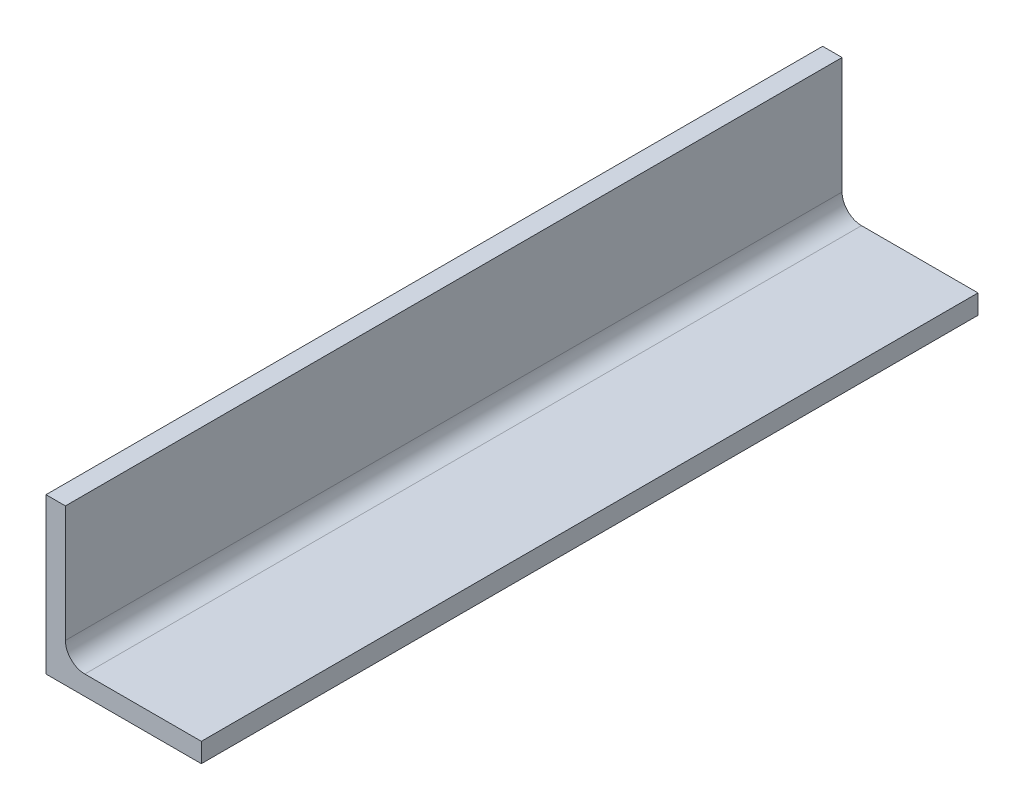
ISO-10303-21;
HEADER;
FILE_DESCRIPTION(('STEP AP214'),'2;1');
FILE_NAME('part.step','',(''),(''),'','','');
FILE_SCHEMA(('AUTOMOTIVE_DESIGN { 1 0 10303 214 1 1 1 1 }'));
ENDSEC;
DATA;
#1=APPLICATION_CONTEXT('core data for automotive mechanical design processes');
#2=APPLICATION_PROTOCOL_DEFINITION('international standard','automotive_design',2000,#1);
#3=PRODUCT_CONTEXT('',#1,'mechanical');
#4=PRODUCT('Part','Part','',(#3));
#5=PRODUCT_RELATED_PRODUCT_CATEGORY('part','',(#4));
#6=PRODUCT_DEFINITION_FORMATION('','',#4);
#7=PRODUCT_DEFINITION_CONTEXT('part definition',#1,'design');
#8=PRODUCT_DEFINITION('design','',#6,#7);
#9=PRODUCT_DEFINITION_SHAPE('','',#8);
#10=(LENGTH_UNIT() NAMED_UNIT(*) SI_UNIT(.MILLI.,.METRE.));
#11=(NAMED_UNIT(*) PLANE_ANGLE_UNIT() SI_UNIT($,.RADIAN.));
#12=(NAMED_UNIT(*) SI_UNIT($,.STERADIAN.) SOLID_ANGLE_UNIT());
#13=UNCERTAINTY_MEASURE_WITH_UNIT(LENGTH_MEASURE(1.E-05),#10,'distance_accuracy_value','');
#14=(GEOMETRIC_REPRESENTATION_CONTEXT(3) GLOBAL_UNCERTAINTY_ASSIGNED_CONTEXT((#13)) GLOBAL_UNIT_ASSIGNED_CONTEXT((#10,
#11,#12)) REPRESENTATION_CONTEXT('',''));
#15=CARTESIAN_POINT('',(0.,0.,0.));
#16=DIRECTION('',(0.,0.,1.));
#17=DIRECTION('',(1.,0.,0.));
#18=AXIS2_PLACEMENT_3D('',#15,#16,#17);
#19=CARTESIAN_POINT('',(50.8,0.,127.));
#20=DIRECTION('',(0.,1.,0.));
#21=DIRECTION('',(-1.,0.,0.));
#22=AXIS2_PLACEMENT_3D('',#19,#20,#21);
#23=PLANE('',#22);
#24=DIRECTION('',(1.,0.,0.));
#25=VECTOR('',#24,1.);
#26=CARTESIAN_POINT('',(50.8,0.,-127.));
#27=LINE('',#26,#25);
#28=CARTESIAN_POINT('',(0.,0.,-127.));
#29=VERTEX_POINT('',#28);
#30=CARTESIAN_POINT('',(50.8,0.,-127.));
#31=VERTEX_POINT('',#30);
#32=EDGE_CURVE('E107',#29,#31,#27,.T.);
#33=ORIENTED_EDGE('',*,*,#32,.T.);
#34=DIRECTION('',(0.,0.,-1.));
#35=VECTOR('',#34,1.);
#36=CARTESIAN_POINT('',(50.8,0.,127.));
#37=LINE('',#36,#35);
#38=CARTESIAN_POINT('',(50.8,0.,127.));
#39=VERTEX_POINT('',#38);
#40=EDGE_CURVE('E11',#39,#31,#37,.T.);
#41=ORIENTED_EDGE('',*,*,#40,.F.);
#42=DIRECTION('',(1.,0.,0.));
#43=VECTOR('',#42,1.);
#44=CARTESIAN_POINT('',(50.8,0.,127.));
#45=LINE('',#44,#43);
#46=CARTESIAN_POINT('',(0.,0.,127.));
#47=VERTEX_POINT('',#46);
#48=EDGE_CURVE('E119',#47,#39,#45,.T.);
#49=ORIENTED_EDGE('',*,*,#48,.F.);
#50=DIRECTION('',(0.,0.,-1.));
#51=VECTOR('',#50,1.);
#52=CARTESIAN_POINT('',(0.,0.,127.));
#53=LINE('',#52,#51);
#54=EDGE_CURVE('E103',#47,#29,#53,.T.);
#55=ORIENTED_EDGE('',*,*,#54,.T.);
#56=EDGE_LOOP('',(#33,#41,#49,#55));
#57=FACE_BOUND('',#56,.T.);
#58=ADVANCED_FACE('F17',(#57),#23,.F.);
#59=CARTESIAN_POINT('',(50.8,6.35,127.));
#60=DIRECTION('',(-1.,0.,0.));
#61=DIRECTION('',(0.,0.,1.));
#62=AXIS2_PLACEMENT_3D('',#59,#60,#61);
#63=PLANE('',#62);
#64=DIRECTION('',(0.,1.,0.));
#65=VECTOR('',#64,1.);
#66=CARTESIAN_POINT('',(50.8,6.35,-127.));
#67=LINE('',#66,#65);
#68=CARTESIAN_POINT('',(50.8,6.35,-127.));
#69=VERTEX_POINT('',#68);
#70=EDGE_CURVE('E110',#31,#69,#67,.T.);
#71=ORIENTED_EDGE('',*,*,#70,.T.);
#72=DIRECTION('',(0.,0.,-1.));
#73=VECTOR('',#72,1.);
#74=CARTESIAN_POINT('',(50.8,6.35,127.));
#75=LINE('',#74,#73);
#76=CARTESIAN_POINT('',(50.8,6.35,127.));
#77=VERTEX_POINT('',#76);
#78=EDGE_CURVE('E25',#77,#69,#75,.T.);
#79=ORIENTED_EDGE('',*,*,#78,.F.);
#80=DIRECTION('',(0.,1.,0.));
#81=VECTOR('',#80,1.);
#82=CARTESIAN_POINT('',(50.8,6.35,127.));
#83=LINE('',#82,#81);
#84=EDGE_CURVE('E73',#39,#77,#83,.T.);
#85=ORIENTED_EDGE('',*,*,#84,.F.);
#86=ORIENTED_EDGE('',*,*,#40,.T.);
#87=EDGE_LOOP('',(#71,#79,#85,#86));
#88=FACE_BOUND('',#87,.T.);
#89=ADVANCED_FACE('F144',(#88),#63,.F.);
#90=CARTESIAN_POINT('',(12.7,6.35,127.));
#91=DIRECTION('',(0.,-1.,0.));
#92=DIRECTION('',(0.,0.,-1.));
#93=AXIS2_PLACEMENT_3D('',#90,#91,#92);
#94=PLANE('',#93);
#95=DIRECTION('',(-1.,0.,0.));
#96=VECTOR('',#95,1.);
#97=CARTESIAN_POINT('',(12.7,6.35,-127.));
#98=LINE('',#97,#96);
#99=CARTESIAN_POINT('',(12.7,6.35,-127.));
#100=VERTEX_POINT('',#99);
#101=EDGE_CURVE('E112',#69,#100,#98,.T.);
#102=ORIENTED_EDGE('',*,*,#101,.T.);
#103=DIRECTION('',(0.,0.,-1.));
#104=VECTOR('',#103,1.);
#105=CARTESIAN_POINT('',(12.7,6.35,127.));
#106=LINE('',#105,#104);
#107=CARTESIAN_POINT('',(12.7,6.35,127.));
#108=VERTEX_POINT('',#107);
#109=EDGE_CURVE('E123',#108,#100,#106,.T.);
#110=ORIENTED_EDGE('',*,*,#109,.F.);
#111=DIRECTION('',(-1.,0.,0.));
#112=VECTOR('',#111,1.);
#113=CARTESIAN_POINT('',(12.7,6.35,127.));
#114=LINE('',#113,#112);
#115=EDGE_CURVE('E131',#77,#108,#114,.T.);
#116=ORIENTED_EDGE('',*,*,#115,.F.);
#117=ORIENTED_EDGE('',*,*,#78,.T.);
#118=EDGE_LOOP('',(#102,#110,#116,#117));
#119=FACE_BOUND('',#118,.T.);
#120=ADVANCED_FACE('F129',(#119),#94,.F.);
#121=CARTESIAN_POINT('',(12.7,12.7,127.));
#122=DIRECTION('',(0.,0.,-1.));
#123=DIRECTION('',(-1.,0.,0.));
#124=AXIS2_PLACEMENT_3D('',#121,#122,#123);
#125=CYLINDRICAL_SURFACE('',#124,6.35);
#126=CARTESIAN_POINT('',(12.7,12.7,-127.));
#127=DIRECTION('',(0.,0.,-1.));
#128=DIRECTION('',(-1.,0.,0.));
#129=AXIS2_PLACEMENT_3D('',#126,#127,#128);
#130=CIRCLE('',#129,6.35);
#131=CARTESIAN_POINT('',(6.35,12.7,-127.));
#132=VERTEX_POINT('',#131);
#133=EDGE_CURVE('E114',#100,#132,#130,.T.);
#134=ORIENTED_EDGE('',*,*,#133,.T.);
#135=DIRECTION('',(0.,0.,-1.));
#136=VECTOR('',#135,1.);
#137=CARTESIAN_POINT('',(6.35,12.7,127.));
#138=LINE('',#137,#136);
#139=CARTESIAN_POINT('',(6.35,12.7,127.));
#140=VERTEX_POINT('',#139);
#141=EDGE_CURVE('E98',#140,#132,#138,.T.);
#142=ORIENTED_EDGE('',*,*,#141,.F.);
#143=CARTESIAN_POINT('',(12.7,12.7,127.));
#144=DIRECTION('',(0.,0.,-1.));
#145=DIRECTION('',(-1.,0.,0.));
#146=AXIS2_PLACEMENT_3D('',#143,#144,#145);
#147=CIRCLE('',#146,6.35);
#148=EDGE_CURVE('E89',#108,#140,#147,.T.);
#149=ORIENTED_EDGE('',*,*,#148,.F.);
#150=ORIENTED_EDGE('',*,*,#109,.T.);
#151=EDGE_LOOP('',(#134,#142,#149,#150));
#152=FACE_BOUND('',#151,.T.);
#153=ADVANCED_FACE('F137',(#152),#125,.F.);
#154=CARTESIAN_POINT('',(6.35,50.8,127.));
#155=DIRECTION('',(-1.,0.,0.));
#156=DIRECTION('',(0.,-1.,0.));
#157=AXIS2_PLACEMENT_3D('',#154,#155,#156);
#158=PLANE('',#157);
#159=DIRECTION('',(0.,1.,0.));
#160=VECTOR('',#159,1.);
#161=CARTESIAN_POINT('',(6.35,50.8,-127.));
#162=LINE('',#161,#160);
#163=CARTESIAN_POINT('',(6.35,50.8,-127.));
#164=VERTEX_POINT('',#163);
#165=EDGE_CURVE('E97',#132,#164,#162,.T.);
#166=ORIENTED_EDGE('',*,*,#165,.T.);
#167=DIRECTION('',(0.,0.,-1.));
#168=VECTOR('',#167,1.);
#169=CARTESIAN_POINT('',(6.35,50.8,127.));
#170=LINE('',#169,#168);
#171=CARTESIAN_POINT('',(6.35,50.8,127.));
#172=VERTEX_POINT('',#171);
#173=EDGE_CURVE('E94',#172,#164,#170,.T.);
#174=ORIENTED_EDGE('',*,*,#173,.F.);
#175=DIRECTION('',(0.,1.,0.));
#176=VECTOR('',#175,1.);
#177=CARTESIAN_POINT('',(6.35,50.8,127.));
#178=LINE('',#177,#176);
#179=EDGE_CURVE('E83',#140,#172,#178,.T.);
#180=ORIENTED_EDGE('',*,*,#179,.F.);
#181=ORIENTED_EDGE('',*,*,#141,.T.);
#182=EDGE_LOOP('',(#166,#174,#180,#181));
#183=FACE_BOUND('',#182,.T.);
#184=ADVANCED_FACE('F95',(#183),#158,.F.);
#185=CARTESIAN_POINT('',(0.,50.8,127.));
#186=DIRECTION('',(0.,-1.,0.));
#187=DIRECTION('',(0.,0.,-1.));
#188=AXIS2_PLACEMENT_3D('',#185,#186,#187);
#189=PLANE('',#188);
#190=DIRECTION('',(-1.,0.,0.));
#191=VECTOR('',#190,1.);
#192=CARTESIAN_POINT('',(0.,50.8,-127.));
#193=LINE('',#192,#191);
#194=CARTESIAN_POINT('',(0.,50.8,-127.));
#195=VERTEX_POINT('',#194);
#196=EDGE_CURVE('E59',#164,#195,#193,.T.);
#197=ORIENTED_EDGE('',*,*,#196,.T.);
#198=DIRECTION('',(0.,0.,-1.));
#199=VECTOR('',#198,1.);
#200=CARTESIAN_POINT('',(0.,50.8,127.));
#201=LINE('',#200,#199);
#202=CARTESIAN_POINT('',(0.,50.8,127.));
#203=VERTEX_POINT('',#202);
#204=EDGE_CURVE('E99',#203,#195,#201,.T.);
#205=ORIENTED_EDGE('',*,*,#204,.F.);
#206=DIRECTION('',(-1.,0.,0.));
#207=VECTOR('',#206,1.);
#208=CARTESIAN_POINT('',(0.,50.8,127.));
#209=LINE('',#208,#207);
#210=EDGE_CURVE('E87',#172,#203,#209,.T.);
#211=ORIENTED_EDGE('',*,*,#210,.F.);
#212=ORIENTED_EDGE('',*,*,#173,.T.);
#213=EDGE_LOOP('',(#197,#205,#211,#212));
#214=FACE_BOUND('',#213,.T.);
#215=ADVANCED_FACE('F101',(#214),#189,.F.);
#216=CARTESIAN_POINT('',(0.,0.,127.));
#217=DIRECTION('',(1.,0.,0.));
#218=DIRECTION('',(0.,0.,-1.));
#219=AXIS2_PLACEMENT_3D('',#216,#217,#218);
#220=PLANE('',#219);
#221=DIRECTION('',(0.,-1.,0.));
#222=VECTOR('',#221,1.);
#223=CARTESIAN_POINT('',(0.,0.,-127.));
#224=LINE('',#223,#222);
#225=EDGE_CURVE('E65',#195,#29,#224,.T.);
#226=ORIENTED_EDGE('',*,*,#225,.T.);
#227=ORIENTED_EDGE('',*,*,#54,.F.);
#228=DIRECTION('',(0.,-1.,0.));
#229=VECTOR('',#228,1.);
#230=CARTESIAN_POINT('',(0.,0.,127.));
#231=LINE('',#230,#229);
#232=EDGE_CURVE('E33',#203,#47,#231,.T.);
#233=ORIENTED_EDGE('',*,*,#232,.F.);
#234=ORIENTED_EDGE('',*,*,#204,.T.);
#235=EDGE_LOOP('',(#226,#227,#233,#234));
#236=FACE_BOUND('',#235,.T.);
#237=ADVANCED_FACE('F160',(#236),#220,.F.);
#238=CARTESIAN_POINT('',(12.7,12.7,127.));
#239=DIRECTION('',(0.,0.,-1.));
#240=DIRECTION('',(-1.,0.,0.));
#241=AXIS2_PLACEMENT_3D('',#238,#239,#240);
#242=PLANE('',#241);
#243=ORIENTED_EDGE('',*,*,#48,.T.);
#244=ORIENTED_EDGE('',*,*,#84,.T.);
#245=ORIENTED_EDGE('',*,*,#115,.T.);
#246=ORIENTED_EDGE('',*,*,#148,.T.);
#247=ORIENTED_EDGE('',*,*,#179,.T.);
#248=ORIENTED_EDGE('',*,*,#210,.T.);
#249=ORIENTED_EDGE('',*,*,#232,.T.);
#250=EDGE_LOOP('',(#243,#244,#245,#246,#247,#248,#249));
#251=FACE_BOUND('',#250,.T.);
#252=ADVANCED_FACE('F85',(#251),#242,.F.);
#253=CARTESIAN_POINT('',(12.7,12.7,-127.));
#254=DIRECTION('',(0.,0.,-1.));
#255=DIRECTION('',(-1.,0.,0.));
#256=AXIS2_PLACEMENT_3D('',#253,#254,#255);
#257=PLANE('',#256);
#258=ORIENTED_EDGE('',*,*,#32,.F.);
#259=ORIENTED_EDGE('',*,*,#225,.F.);
#260=ORIENTED_EDGE('',*,*,#196,.F.);
#261=ORIENTED_EDGE('',*,*,#165,.F.);
#262=ORIENTED_EDGE('',*,*,#133,.F.);
#263=ORIENTED_EDGE('',*,*,#101,.F.);
#264=ORIENTED_EDGE('',*,*,#70,.F.);
#265=EDGE_LOOP('',(#258,#259,#260,#261,#262,#263,#264));
#266=FACE_BOUND('',#265,.T.);
#267=ADVANCED_FACE('F135',(#266),#257,.T.);
#268=CLOSED_SHELL('',(#58,#89,#120,#153,#184,#215,#237,#252,#267));
#269=MANIFOLD_SOLID_BREP('B1',#268);
#270=ADVANCED_BREP_SHAPE_REPRESENTATION('',(#18,#269),#14);
#271=SHAPE_DEFINITION_REPRESENTATION(#9,#270);
ENDSEC;
END-ISO-10303-21;
